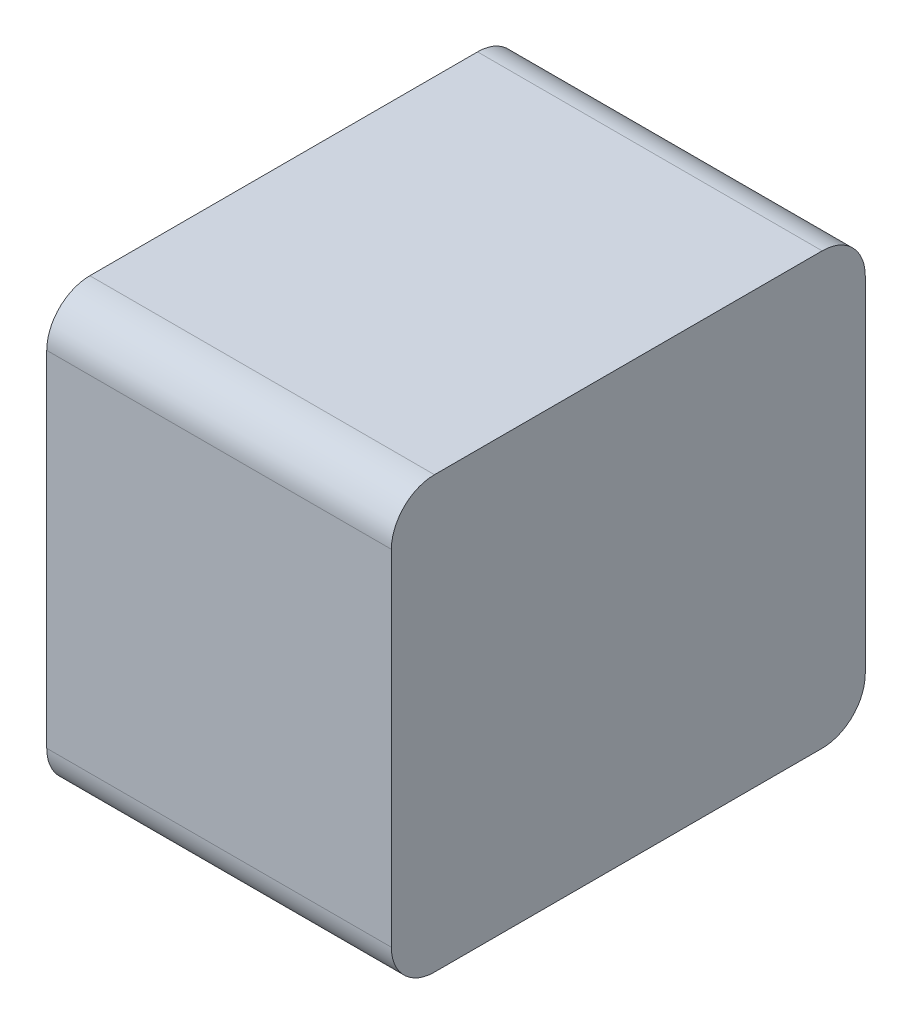
ISO-10303-21;
HEADER;
FILE_DESCRIPTION(('STEP AP214'),'2;1');
FILE_NAME('part.step','',(''),(''),'','','');
FILE_SCHEMA(('AUTOMOTIVE_DESIGN { 1 0 10303 214 1 1 1 1 }'));
ENDSEC;
DATA;
#1=APPLICATION_CONTEXT('core data for automotive mechanical design processes');
#2=APPLICATION_PROTOCOL_DEFINITION('international standard','automotive_design',2000,#1);
#3=PRODUCT_CONTEXT('',#1,'mechanical');
#4=PRODUCT('Part','Part','',(#3));
#5=PRODUCT_RELATED_PRODUCT_CATEGORY('part','',(#4));
#6=PRODUCT_DEFINITION_FORMATION('','',#4);
#7=PRODUCT_DEFINITION_CONTEXT('part definition',#1,'design');
#8=PRODUCT_DEFINITION('design','',#6,#7);
#9=PRODUCT_DEFINITION_SHAPE('','',#8);
#10=(LENGTH_UNIT() NAMED_UNIT(*) SI_UNIT(.MILLI.,.METRE.));
#11=(NAMED_UNIT(*) PLANE_ANGLE_UNIT() SI_UNIT($,.RADIAN.));
#12=(NAMED_UNIT(*) SI_UNIT($,.STERADIAN.) SOLID_ANGLE_UNIT());
#13=UNCERTAINTY_MEASURE_WITH_UNIT(LENGTH_MEASURE(1.E-05),#10,'distance_accuracy_value','');
#14=(GEOMETRIC_REPRESENTATION_CONTEXT(3) GLOBAL_UNCERTAINTY_ASSIGNED_CONTEXT((#13)) GLOBAL_UNIT_ASSIGNED_CONTEXT((#10,
#11,#12)) REPRESENTATION_CONTEXT('',''));
#15=CARTESIAN_POINT('',(0.,0.,0.));
#16=DIRECTION('',(0.,0.,1.));
#17=DIRECTION('',(1.,0.,0.));
#18=AXIS2_PLACEMENT_3D('',#15,#16,#17);
#19=CARTESIAN_POINT('',(-0.1,-0.2,0.5));
#20=DIRECTION('',(1.,0.,0.));
#21=DIRECTION('',(0.,-0.707106781186547,0.707106781186548));
#22=AXIS2_PLACEMENT_3D('',#19,#20,#21);
#23=CYLINDRICAL_SURFACE('',#22,0.05);
#24=CARTESIAN_POINT('',(0.2,-0.2,0.5));
#25=DIRECTION('',(-1.,0.,0.));
#26=DIRECTION('',(0.,-0.707106781186547,0.707106781186548));
#27=AXIS2_PLACEMENT_3D('',#24,#25,#26);
#28=CIRCLE('',#27,0.05);
#29=CARTESIAN_POINT('',(0.2,-0.25,0.5));
#30=VERTEX_POINT('',#29);
#31=CARTESIAN_POINT('',(0.2,-0.2,0.55));
#32=VERTEX_POINT('',#31);
#33=EDGE_CURVE('E11',#30,#32,#28,.T.);
#34=ORIENTED_EDGE('',*,*,#33,.T.);
#35=DIRECTION('',(-1.,0.,0.));
#36=VECTOR('',#35,1.);
#37=CARTESIAN_POINT('',(-0.1,-0.2,0.55));
#38=LINE('',#37,#36);
#39=CARTESIAN_POINT('',(-0.2,-0.2,0.55));
#40=VERTEX_POINT('',#39);
#41=EDGE_CURVE('E24',#32,#40,#38,.T.);
#42=ORIENTED_EDGE('',*,*,#41,.T.);
#43=CARTESIAN_POINT('',(-0.2,-0.2,0.5));
#44=DIRECTION('',(1.,0.,0.));
#45=DIRECTION('',(0.,-0.707106781186547,0.707106781186548));
#46=AXIS2_PLACEMENT_3D('',#43,#44,#45);
#47=CIRCLE('',#46,0.05);
#48=CARTESIAN_POINT('',(-0.2,-0.25,0.5));
#49=VERTEX_POINT('',#48);
#50=EDGE_CURVE('E145',#40,#49,#47,.T.);
#51=ORIENTED_EDGE('',*,*,#50,.T.);
#52=DIRECTION('',(1.,0.,0.));
#53=VECTOR('',#52,1.);
#54=CARTESIAN_POINT('',(-0.1,-0.25,0.5));
#55=LINE('',#54,#53);
#56=EDGE_CURVE('E143',#49,#30,#55,.T.);
#57=ORIENTED_EDGE('',*,*,#56,.T.);
#58=EDGE_LOOP('',(#34,#42,#51,#57));
#59=FACE_BOUND('',#58,.T.);
#60=ADVANCED_FACE('F17',(#59),#23,.T.);
#61=CARTESIAN_POINT('',(-0.2,-0.25,0.));
#62=DIRECTION('',(0.,-1.,0.));
#63=DIRECTION('',(1.,0.,0.));
#64=AXIS2_PLACEMENT_3D('',#61,#62,#63);
#65=PLANE('',#64);
#66=ORIENTED_EDGE('',*,*,#56,.F.);
#67=DIRECTION('',(0.,0.,1.));
#68=VECTOR('',#67,1.);
#69=CARTESIAN_POINT('',(-0.2,-0.25,0.));
#70=LINE('',#69,#68);
#71=CARTESIAN_POINT('',(-0.2,-0.25,0.05));
#72=VERTEX_POINT('',#71);
#73=EDGE_CURVE('E140',#72,#49,#70,.T.);
#74=ORIENTED_EDGE('',*,*,#73,.F.);
#75=DIRECTION('',(-1.,0.,0.));
#76=VECTOR('',#75,1.);
#77=CARTESIAN_POINT('',(-0.1,-0.25,0.05));
#78=LINE('',#77,#76);
#79=CARTESIAN_POINT('',(0.2,-0.25,0.05));
#80=VERTEX_POINT('',#79);
#81=EDGE_CURVE('E138',#80,#72,#78,.T.);
#82=ORIENTED_EDGE('',*,*,#81,.F.);
#83=DIRECTION('',(0.,0.,1.));
#84=VECTOR('',#83,1.);
#85=CARTESIAN_POINT('',(0.2,-0.25,0.));
#86=LINE('',#85,#84);
#87=EDGE_CURVE('E84',#80,#30,#86,.T.);
#88=ORIENTED_EDGE('',*,*,#87,.T.);
#89=EDGE_LOOP('',(#66,#74,#82,#88));
#90=FACE_BOUND('',#89,.T.);
#91=ADVANCED_FACE('F172',(#90),#65,.T.);
#92=CARTESIAN_POINT('',(-0.2,0.25,0.));
#93=DIRECTION('',(-1.,0.,0.));
#94=DIRECTION('',(0.,-1.,0.));
#95=AXIS2_PLACEMENT_3D('',#92,#93,#94);
#96=PLANE('',#95);
#97=ORIENTED_EDGE('',*,*,#50,.F.);
#98=DIRECTION('',(0.,-1.,0.));
#99=VECTOR('',#98,1.);
#100=CARTESIAN_POINT('',(-0.2,0.25,0.55));
#101=LINE('',#100,#99);
#102=CARTESIAN_POINT('',(-0.2,0.2,0.55));
#103=VERTEX_POINT('',#102);
#104=EDGE_CURVE('E134',#103,#40,#101,.T.);
#105=ORIENTED_EDGE('',*,*,#104,.F.);
#106=CARTESIAN_POINT('',(-0.2,0.2,0.5));
#107=DIRECTION('',(1.,0.,0.));
#108=DIRECTION('',(0.,0.707106781186547,0.707106781186548));
#109=AXIS2_PLACEMENT_3D('',#106,#107,#108);
#110=CIRCLE('',#109,0.05);
#111=CARTESIAN_POINT('',(-0.2,0.25,0.5));
#112=VERTEX_POINT('',#111);
#113=EDGE_CURVE('E131',#112,#103,#110,.T.);
#114=ORIENTED_EDGE('',*,*,#113,.F.);
#115=DIRECTION('',(0.,0.,1.));
#116=VECTOR('',#115,1.);
#117=CARTESIAN_POINT('',(-0.2,0.25,0.));
#118=LINE('',#117,#116);
#119=CARTESIAN_POINT('',(-0.2,0.25,0.05));
#120=VERTEX_POINT('',#119);
#121=EDGE_CURVE('E128',#120,#112,#118,.T.);
#122=ORIENTED_EDGE('',*,*,#121,.F.);
#123=CARTESIAN_POINT('',(-0.2,0.2,0.05));
#124=DIRECTION('',(1.,0.,0.));
#125=DIRECTION('',(0.,0.707106781186547,-0.707106781186548));
#126=AXIS2_PLACEMENT_3D('',#123,#124,#125);
#127=CIRCLE('',#126,0.05);
#128=CARTESIAN_POINT('',(-0.2,0.2,0.));
#129=VERTEX_POINT('',#128);
#130=EDGE_CURVE('E125',#129,#120,#127,.T.);
#131=ORIENTED_EDGE('',*,*,#130,.F.);
#132=DIRECTION('',(0.,-1.,0.));
#133=VECTOR('',#132,1.);
#134=CARTESIAN_POINT('',(-0.2,0.25,0.));
#135=LINE('',#134,#133);
#136=CARTESIAN_POINT('',(-0.2,-0.2,0.));
#137=VERTEX_POINT('',#136);
#138=EDGE_CURVE('E123',#129,#137,#135,.T.);
#139=ORIENTED_EDGE('',*,*,#138,.T.);
#140=CARTESIAN_POINT('',(-0.2,-0.2,0.05));
#141=DIRECTION('',(1.,0.,0.));
#142=DIRECTION('',(0.,-0.707106781186547,-0.707106781186548));
#143=AXIS2_PLACEMENT_3D('',#140,#141,#142);
#144=CIRCLE('',#143,0.05);
#145=EDGE_CURVE('E94',#72,#137,#144,.T.);
#146=ORIENTED_EDGE('',*,*,#145,.F.);
#147=ORIENTED_EDGE('',*,*,#73,.T.);
#148=EDGE_LOOP('',(#97,#105,#114,#122,#131,#139,#146,#147));
#149=FACE_BOUND('',#148,.T.);
#150=ADVANCED_FACE('F150',(#149),#96,.T.);
#151=CARTESIAN_POINT('',(0.1,0.2,0.5));
#152=DIRECTION('',(-1.,0.,0.));
#153=DIRECTION('',(0.,0.707106781186547,0.707106781186548));
#154=AXIS2_PLACEMENT_3D('',#151,#152,#153);
#155=CYLINDRICAL_SURFACE('',#154,0.05);
#156=ORIENTED_EDGE('',*,*,#113,.T.);
#157=DIRECTION('',(1.,0.,0.));
#158=VECTOR('',#157,1.);
#159=CARTESIAN_POINT('',(0.1,0.2,0.55));
#160=LINE('',#159,#158);
#161=CARTESIAN_POINT('',(0.2,0.2,0.55));
#162=VERTEX_POINT('',#161);
#163=EDGE_CURVE('E120',#103,#162,#160,.T.);
#164=ORIENTED_EDGE('',*,*,#163,.T.);
#165=CARTESIAN_POINT('',(0.2,0.2,0.5));
#166=DIRECTION('',(-1.,0.,0.));
#167=DIRECTION('',(0.,0.707106781186547,0.707106781186548));
#168=AXIS2_PLACEMENT_3D('',#165,#166,#167);
#169=CIRCLE('',#168,0.05);
#170=CARTESIAN_POINT('',(0.2,0.25,0.5));
#171=VERTEX_POINT('',#170);
#172=EDGE_CURVE('E118',#162,#171,#169,.T.);
#173=ORIENTED_EDGE('',*,*,#172,.T.);
#174=DIRECTION('',(-1.,0.,0.));
#175=VECTOR('',#174,1.);
#176=CARTESIAN_POINT('',(0.1,0.25,0.5));
#177=LINE('',#176,#175);
#178=EDGE_CURVE('E115',#171,#112,#177,.T.);
#179=ORIENTED_EDGE('',*,*,#178,.T.);
#180=EDGE_LOOP('',(#156,#164,#173,#179));
#181=FACE_BOUND('',#180,.T.);
#182=ADVANCED_FACE('F155',(#181),#155,.T.);
#183=CARTESIAN_POINT('',(0.2,0.25,0.));
#184=DIRECTION('',(0.,1.,0.));
#185=DIRECTION('',(-1.,0.,0.));
#186=AXIS2_PLACEMENT_3D('',#183,#184,#185);
#187=PLANE('',#186);
#188=ORIENTED_EDGE('',*,*,#178,.F.);
#189=DIRECTION('',(0.,0.,1.));
#190=VECTOR('',#189,1.);
#191=CARTESIAN_POINT('',(0.2,0.25,0.));
#192=LINE('',#191,#190);
#193=CARTESIAN_POINT('',(0.2,0.25,0.05));
#194=VERTEX_POINT('',#193);
#195=EDGE_CURVE('E112',#194,#171,#192,.T.);
#196=ORIENTED_EDGE('',*,*,#195,.F.);
#197=DIRECTION('',(1.,0.,0.));
#198=VECTOR('',#197,1.);
#199=CARTESIAN_POINT('',(0.1,0.25,0.05));
#200=LINE('',#199,#198);
#201=EDGE_CURVE('E109',#120,#194,#200,.T.);
#202=ORIENTED_EDGE('',*,*,#201,.F.);
#203=ORIENTED_EDGE('',*,*,#121,.T.);
#204=EDGE_LOOP('',(#188,#196,#202,#203));
#205=FACE_BOUND('',#204,.T.);
#206=ADVANCED_FACE('F159',(#205),#187,.T.);
#207=CARTESIAN_POINT('',(0.1,0.2,0.05));
#208=DIRECTION('',(-1.,0.,0.));
#209=DIRECTION('',(0.,0.707106781186547,-0.707106781186548));
#210=AXIS2_PLACEMENT_3D('',#207,#208,#209);
#211=CYLINDRICAL_SURFACE('',#210,0.05);
#212=ORIENTED_EDGE('',*,*,#130,.T.);
#213=ORIENTED_EDGE('',*,*,#201,.T.);
#214=CARTESIAN_POINT('',(0.2,0.2,0.05));
#215=DIRECTION('',(-1.,0.,0.));
#216=DIRECTION('',(0.,0.707106781186547,-0.707106781186548));
#217=AXIS2_PLACEMENT_3D('',#214,#215,#216);
#218=CIRCLE('',#217,0.05);
#219=CARTESIAN_POINT('',(0.2,0.2,0.));
#220=VERTEX_POINT('',#219);
#221=EDGE_CURVE('E107',#194,#220,#218,.T.);
#222=ORIENTED_EDGE('',*,*,#221,.T.);
#223=DIRECTION('',(-1.,0.,0.));
#224=VECTOR('',#223,1.);
#225=CARTESIAN_POINT('',(0.1,0.2,0.));
#226=LINE('',#225,#224);
#227=EDGE_CURVE('E87',#220,#129,#226,.T.);
#228=ORIENTED_EDGE('',*,*,#227,.T.);
#229=EDGE_LOOP('',(#212,#213,#222,#228));
#230=FACE_BOUND('',#229,.T.);
#231=ADVANCED_FACE('F161',(#230),#211,.T.);
#232=CARTESIAN_POINT('',(-0.1,-0.2,0.05));
#233=DIRECTION('',(1.,0.,0.));
#234=DIRECTION('',(0.,-0.707106781186547,-0.707106781186548));
#235=AXIS2_PLACEMENT_3D('',#232,#233,#234);
#236=CYLINDRICAL_SURFACE('',#235,0.05);
#237=CARTESIAN_POINT('',(0.2,-0.2,0.05));
#238=DIRECTION('',(-1.,0.,0.));
#239=DIRECTION('',(0.,-0.707106781186547,-0.707106781186548));
#240=AXIS2_PLACEMENT_3D('',#237,#238,#239);
#241=CIRCLE('',#240,0.05);
#242=CARTESIAN_POINT('',(0.2,-0.2,0.));
#243=VERTEX_POINT('',#242);
#244=EDGE_CURVE('E77',#243,#80,#241,.T.);
#245=ORIENTED_EDGE('',*,*,#244,.T.);
#246=ORIENTED_EDGE('',*,*,#81,.T.);
#247=ORIENTED_EDGE('',*,*,#145,.T.);
#248=DIRECTION('',(1.,0.,0.));
#249=VECTOR('',#248,1.);
#250=CARTESIAN_POINT('',(-0.1,-0.2,0.));
#251=LINE('',#250,#249);
#252=EDGE_CURVE('E88',#137,#243,#251,.T.);
#253=ORIENTED_EDGE('',*,*,#252,.T.);
#254=EDGE_LOOP('',(#245,#246,#247,#253));
#255=FACE_BOUND('',#254,.T.);
#256=ADVANCED_FACE('F92',(#255),#236,.T.);
#257=CARTESIAN_POINT('',(0.2,-0.25,0.));
#258=DIRECTION('',(1.,0.,0.));
#259=DIRECTION('',(0.,1.,0.));
#260=AXIS2_PLACEMENT_3D('',#257,#258,#259);
#261=PLANE('',#260);
#262=ORIENTED_EDGE('',*,*,#33,.F.);
#263=ORIENTED_EDGE('',*,*,#87,.F.);
#264=ORIENTED_EDGE('',*,*,#244,.F.);
#265=DIRECTION('',(0.,1.,0.));
#266=VECTOR('',#265,1.);
#267=CARTESIAN_POINT('',(0.2,-0.25,0.));
#268=LINE('',#267,#266);
#269=EDGE_CURVE('E82',#243,#220,#268,.T.);
#270=ORIENTED_EDGE('',*,*,#269,.T.);
#271=ORIENTED_EDGE('',*,*,#221,.F.);
#272=ORIENTED_EDGE('',*,*,#195,.T.);
#273=ORIENTED_EDGE('',*,*,#172,.F.);
#274=DIRECTION('',(0.,1.,0.));
#275=VECTOR('',#274,1.);
#276=CARTESIAN_POINT('',(0.2,-0.25,0.55));
#277=LINE('',#276,#275);
#278=EDGE_CURVE('E101',#32,#162,#277,.T.);
#279=ORIENTED_EDGE('',*,*,#278,.F.);
#280=EDGE_LOOP('',(#262,#263,#264,#270,#271,#272,#273,#279));
#281=FACE_BOUND('',#280,.T.);
#282=ADVANCED_FACE('F79',(#281),#261,.T.);
#283=CARTESIAN_POINT('',(0.,0.,0.55));
#284=DIRECTION('',(0.,0.,1.));
#285=DIRECTION('',(1.,0.,0.));
#286=AXIS2_PLACEMENT_3D('',#283,#284,#285);
#287=PLANE('',#286);
#288=ORIENTED_EDGE('',*,*,#41,.F.);
#289=ORIENTED_EDGE('',*,*,#278,.T.);
#290=ORIENTED_EDGE('',*,*,#163,.F.);
#291=ORIENTED_EDGE('',*,*,#104,.T.);
#292=EDGE_LOOP('',(#288,#289,#290,#291));
#293=FACE_BOUND('',#292,.T.);
#294=ADVANCED_FACE('F152',(#293),#287,.T.);
#295=CARTESIAN_POINT('',(0.,0.,0.));
#296=DIRECTION('',(0.,0.,1.));
#297=DIRECTION('',(1.,0.,0.));
#298=AXIS2_PLACEMENT_3D('',#295,#296,#297);
#299=PLANE('',#298);
#300=ORIENTED_EDGE('',*,*,#227,.F.);
#301=ORIENTED_EDGE('',*,*,#269,.F.);
#302=ORIENTED_EDGE('',*,*,#252,.F.);
#303=ORIENTED_EDGE('',*,*,#138,.F.);
#304=EDGE_LOOP('',(#300,#301,#302,#303));
#305=FACE_BOUND('',#304,.T.);
#306=ADVANCED_FACE('F99',(#305),#299,.F.);
#307=CLOSED_SHELL('',(#60,#91,#150,#182,#206,#231,#256,#282,#294,#306));
#308=MANIFOLD_SOLID_BREP('B1',#307);
#309=ADVANCED_BREP_SHAPE_REPRESENTATION('',(#18,#308),#14);
#310=SHAPE_DEFINITION_REPRESENTATION(#9,#309);
ENDSEC;
END-ISO-10303-21;
